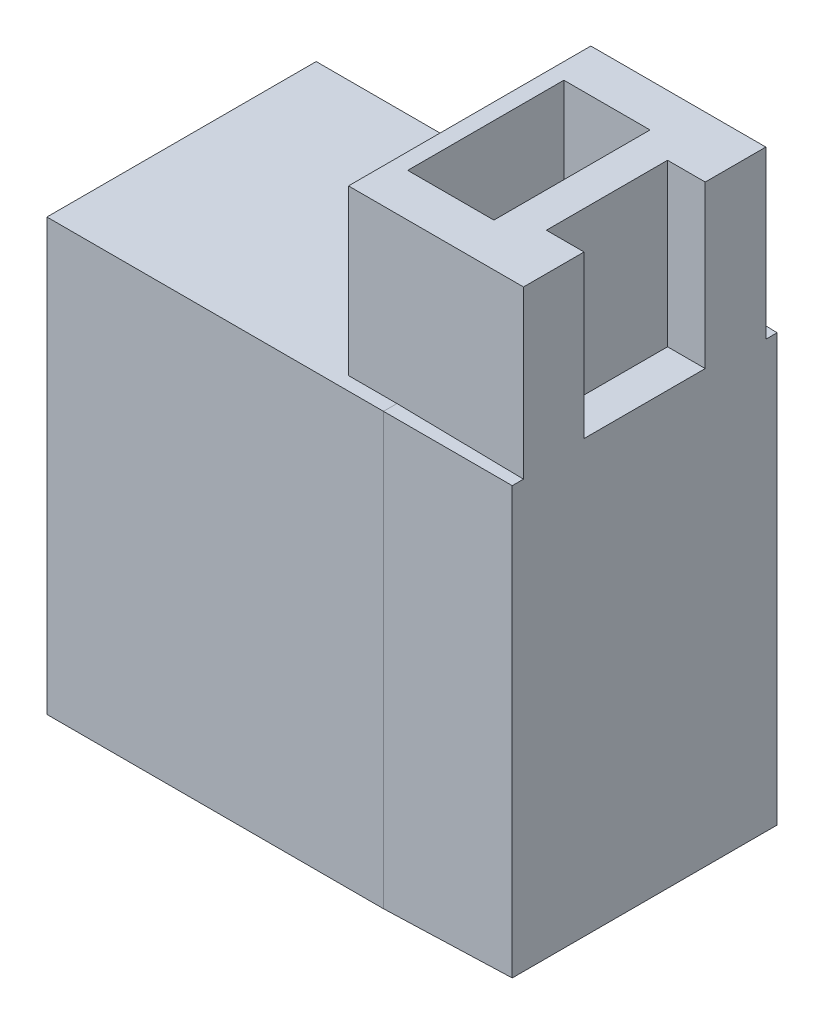
ISO-10303-21;
HEADER;
FILE_DESCRIPTION(('STEP AP214'),'2;1');
FILE_NAME('part.step','',(''),(''),'','','');
FILE_SCHEMA(('AUTOMOTIVE_DESIGN { 1 0 10303 214 1 1 1 1 }'));
ENDSEC;
DATA;
#1=APPLICATION_CONTEXT('core data for automotive mechanical design processes');
#2=APPLICATION_PROTOCOL_DEFINITION('international standard','automotive_design',2000,#1);
#3=PRODUCT_CONTEXT('',#1,'mechanical');
#4=PRODUCT('Part','Part','',(#3));
#5=PRODUCT_RELATED_PRODUCT_CATEGORY('part','',(#4));
#6=PRODUCT_DEFINITION_FORMATION('','',#4);
#7=PRODUCT_DEFINITION_CONTEXT('part definition',#1,'design');
#8=PRODUCT_DEFINITION('design','',#6,#7);
#9=PRODUCT_DEFINITION_SHAPE('','',#8);
#10=(LENGTH_UNIT() NAMED_UNIT(*) SI_UNIT(.MILLI.,.METRE.));
#11=(NAMED_UNIT(*) PLANE_ANGLE_UNIT() SI_UNIT($,.RADIAN.));
#12=(NAMED_UNIT(*) SI_UNIT($,.STERADIAN.) SOLID_ANGLE_UNIT());
#13=UNCERTAINTY_MEASURE_WITH_UNIT(LENGTH_MEASURE(1.E-05),#10,'distance_accuracy_value','');
#14=(GEOMETRIC_REPRESENTATION_CONTEXT(3) GLOBAL_UNCERTAINTY_ASSIGNED_CONTEXT((#13)) GLOBAL_UNIT_ASSIGNED_CONTEXT((#10,
#11,#12)) REPRESENTATION_CONTEXT('',''));
#15=CARTESIAN_POINT('',(0.,0.,0.));
#16=DIRECTION('',(0.,0.,1.));
#17=DIRECTION('',(1.,0.,0.));
#18=AXIS2_PLACEMENT_3D('',#15,#16,#17);
#19=CARTESIAN_POINT('',(2.,16.1,-2.9));
#20=DIRECTION('',(0.,-1.,0.));
#21=DIRECTION('',(0.,0.,-1.));
#22=AXIS2_PLACEMENT_3D('',#19,#20,#21);
#23=PLANE('',#22);
#24=DIRECTION('',(-1.,0.,0.));
#25=VECTOR('',#24,1.);
#26=CARTESIAN_POINT('',(-1.2,16.1,-2.9));
#27=LINE('',#26,#25);
#28=CARTESIAN_POINT('',(2.,16.1,-2.9));
#29=VERTEX_POINT('',#28);
#30=CARTESIAN_POINT('',(-1.2,16.1,-2.9));
#31=VERTEX_POINT('',#30);
#32=EDGE_CURVE('E149',#29,#31,#27,.T.);
#33=ORIENTED_EDGE('',*,*,#32,.T.);
#34=DIRECTION('',(0.,0.,1.));
#35=VECTOR('',#34,1.);
#36=CARTESIAN_POINT('',(-1.2,16.1,2.9));
#37=LINE('',#36,#35);
#38=CARTESIAN_POINT('',(-1.2,16.1,2.9));
#39=VERTEX_POINT('',#38);
#40=EDGE_CURVE('E20',#31,#39,#37,.T.);
#41=ORIENTED_EDGE('',*,*,#40,.T.);
#42=DIRECTION('',(1.,0.,0.));
#43=VECTOR('',#42,1.);
#44=CARTESIAN_POINT('',(-1.2,16.1,2.9));
#45=LINE('',#44,#43);
#46=CARTESIAN_POINT('',(2.,16.1,2.9));
#47=VERTEX_POINT('',#46);
#48=EDGE_CURVE('E145',#39,#47,#45,.T.);
#49=ORIENTED_EDGE('',*,*,#48,.T.);
#50=DIRECTION('',(0.,0.,-1.));
#51=VECTOR('',#50,1.);
#52=CARTESIAN_POINT('',(2.,16.1,2.9));
#53=LINE('',#52,#51);
#54=EDGE_CURVE('E167',#47,#29,#53,.T.);
#55=ORIENTED_EDGE('',*,*,#54,.T.);
#56=EDGE_LOOP('',(#33,#41,#49,#55));
#57=FACE_BOUND('',#56,.T.);
#58=ADVANCED_FACE('F17',(#57),#23,.F.);
#59=CARTESIAN_POINT('',(-1.2,16.1,2.9));
#60=DIRECTION('',(-1.,0.,0.));
#61=DIRECTION('',(0.,0.,1.));
#62=AXIS2_PLACEMENT_3D('',#59,#60,#61);
#63=PLANE('',#62);
#64=DIRECTION('',(0.,1.,0.));
#65=VECTOR('',#64,1.);
#66=CARTESIAN_POINT('',(-1.2,16.1,2.9));
#67=LINE('',#66,#65);
#68=CARTESIAN_POINT('',(-1.2,22.1,2.9));
#69=VERTEX_POINT('',#68);
#70=EDGE_CURVE('E154',#69,#39,#67,.F.);
#71=ORIENTED_EDGE('',*,*,#70,.T.);
#72=ORIENTED_EDGE('',*,*,#40,.F.);
#73=DIRECTION('',(0.,1.,0.));
#74=VECTOR('',#73,1.);
#75=CARTESIAN_POINT('',(-1.2,16.1,-2.9));
#76=LINE('',#75,#74);
#77=CARTESIAN_POINT('',(-1.2,22.1,-2.9));
#78=VERTEX_POINT('',#77);
#79=EDGE_CURVE('E173',#31,#78,#76,.T.);
#80=ORIENTED_EDGE('',*,*,#79,.T.);
#81=DIRECTION('',(0.,0.,-1.));
#82=VECTOR('',#81,1.);
#83=CARTESIAN_POINT('',(-1.2,22.1,4.5));
#84=LINE('',#83,#82);
#85=EDGE_CURVE('E164',#78,#69,#84,.F.);
#86=ORIENTED_EDGE('',*,*,#85,.T.);
#87=EDGE_LOOP('',(#71,#72,#80,#86));
#88=FACE_BOUND('',#87,.T.);
#89=ADVANCED_FACE('F163',(#88),#63,.F.);
#90=CARTESIAN_POINT('',(-1.2,16.1,2.9));
#91=DIRECTION('',(0.,0.,1.));
#92=DIRECTION('',(1.,0.,0.));
#93=AXIS2_PLACEMENT_3D('',#90,#91,#92);
#94=PLANE('',#93);
#95=DIRECTION('',(0.,1.,0.));
#96=VECTOR('',#95,1.);
#97=CARTESIAN_POINT('',(2.,16.1,2.9));
#98=LINE('',#97,#96);
#99=CARTESIAN_POINT('',(2.,22.1,2.9));
#100=VERTEX_POINT('',#99);
#101=EDGE_CURVE('E160',#100,#47,#98,.F.);
#102=ORIENTED_EDGE('',*,*,#101,.T.);
#103=ORIENTED_EDGE('',*,*,#48,.F.);
#104=ORIENTED_EDGE('',*,*,#70,.F.);
#105=DIRECTION('',(1.,0.,0.));
#106=VECTOR('',#105,1.);
#107=CARTESIAN_POINT('',(-1.8,22.1,2.9));
#108=LINE('',#107,#106);
#109=EDGE_CURVE('E183',#69,#100,#108,.T.);
#110=ORIENTED_EDGE('',*,*,#109,.T.);
#111=EDGE_LOOP('',(#102,#103,#104,#110));
#112=FACE_BOUND('',#111,.T.);
#113=ADVANCED_FACE('F157',(#112),#94,.F.);
#114=CARTESIAN_POINT('',(2.,16.1,2.9));
#115=DIRECTION('',(1.,0.,0.));
#116=DIRECTION('',(0.,0.,-1.));
#117=AXIS2_PLACEMENT_3D('',#114,#115,#116);
#118=PLANE('',#117);
#119=DIRECTION('',(0.,1.,0.));
#120=VECTOR('',#119,1.);
#121=CARTESIAN_POINT('',(2.,16.1,-2.9));
#122=LINE('',#121,#120);
#123=CARTESIAN_POINT('',(2.,22.1,-2.9));
#124=VERTEX_POINT('',#123);
#125=EDGE_CURVE('E169',#124,#29,#122,.F.);
#126=ORIENTED_EDGE('',*,*,#125,.T.);
#127=ORIENTED_EDGE('',*,*,#54,.F.);
#128=ORIENTED_EDGE('',*,*,#101,.F.);
#129=DIRECTION('',(0.,0.,-1.));
#130=VECTOR('',#129,1.);
#131=CARTESIAN_POINT('',(2.,22.1,4.5));
#132=LINE('',#131,#130);
#133=EDGE_CURVE('E185',#100,#124,#132,.T.);
#134=ORIENTED_EDGE('',*,*,#133,.T.);
#135=EDGE_LOOP('',(#126,#127,#128,#134));
#136=FACE_BOUND('',#135,.T.);
#137=ADVANCED_FACE('F378',(#136),#118,.F.);
#138=CARTESIAN_POINT('',(-1.2,16.1,-2.9));
#139=DIRECTION('',(0.,0.,-1.));
#140=DIRECTION('',(-1.,0.,0.));
#141=AXIS2_PLACEMENT_3D('',#138,#139,#140);
#142=PLANE('',#141);
#143=ORIENTED_EDGE('',*,*,#79,.F.);
#144=ORIENTED_EDGE('',*,*,#32,.F.);
#145=ORIENTED_EDGE('',*,*,#125,.F.);
#146=DIRECTION('',(1.,0.,0.));
#147=VECTOR('',#146,1.);
#148=CARTESIAN_POINT('',(-1.8,22.1,-2.9));
#149=LINE('',#148,#147);
#150=EDGE_CURVE('E188',#124,#78,#149,.F.);
#151=ORIENTED_EDGE('',*,*,#150,.T.);
#152=EDGE_LOOP('',(#143,#144,#145,#151));
#153=FACE_BOUND('',#152,.T.);
#154=ADVANCED_FACE('F370',(#153),#142,.F.);
#155=CARTESIAN_POINT('',(3.3,16.1,2.25));
#156=DIRECTION('',(-1.,0.,0.));
#157=DIRECTION('',(0.,0.,1.));
#158=AXIS2_PLACEMENT_3D('',#155,#156,#157);
#159=PLANE('',#158);
#160=DIRECTION('',(0.,1.,0.));
#161=VECTOR('',#160,1.);
#162=CARTESIAN_POINT('',(3.3,16.1,2.25));
#163=LINE('',#162,#161);
#164=CARTESIAN_POINT('',(3.3,22.1,2.25));
#165=VERTEX_POINT('',#164);
#166=CARTESIAN_POINT('',(3.3,16.1,2.25));
#167=VERTEX_POINT('',#166);
#168=EDGE_CURVE('E179',#165,#167,#163,.F.);
#169=ORIENTED_EDGE('',*,*,#168,.T.);
#170=DIRECTION('',(0.,0.,1.));
#171=VECTOR('',#170,1.);
#172=CARTESIAN_POINT('',(3.3,16.1,-2.25));
#173=LINE('',#172,#171);
#174=CARTESIAN_POINT('',(3.3,16.1,-2.25));
#175=VERTEX_POINT('',#174);
#176=EDGE_CURVE('E206',#175,#167,#173,.T.);
#177=ORIENTED_EDGE('',*,*,#176,.F.);
#178=DIRECTION('',(0.,1.,0.));
#179=VECTOR('',#178,1.);
#180=CARTESIAN_POINT('',(3.3,16.1,-2.25));
#181=LINE('',#180,#179);
#182=CARTESIAN_POINT('',(3.3,22.1,-2.25));
#183=VERTEX_POINT('',#182);
#184=EDGE_CURVE('E197',#175,#183,#181,.T.);
#185=ORIENTED_EDGE('',*,*,#184,.T.);
#186=DIRECTION('',(0.,0.,-1.));
#187=VECTOR('',#186,1.);
#188=CARTESIAN_POINT('',(3.3,22.1,4.5));
#189=LINE('',#188,#187);
#190=EDGE_CURVE('E191',#183,#165,#189,.F.);
#191=ORIENTED_EDGE('',*,*,#190,.T.);
#192=EDGE_LOOP('',(#169,#177,#185,#191));
#193=FACE_BOUND('',#192,.T.);
#194=ADVANCED_FACE('F368',(#193),#159,.F.);
#195=CARTESIAN_POINT('',(0.,16.,-5.));
#196=DIRECTION('',(0.0174524064372835,0.999847695156391,0.));
#197=DIRECTION('',(-0.999847695156391,0.0174524064372835,0.));
#198=AXIS2_PLACEMENT_3D('',#195,#196,#197);
#199=PLANE('',#198);
#200=DIRECTION('',(0.,0.,1.));
#201=VECTOR('',#200,1.);
#202=CARTESIAN_POINT('',(4.7,15.9179611948374,-5.));
#203=LINE('',#202,#201);
#204=CARTESIAN_POINT('',(4.7,15.9179611948374,-4.5));
#205=VERTEX_POINT('',#204);
#206=CARTESIAN_POINT('',(4.7,15.9179611948374,-4.91796119483738));
#207=VERTEX_POINT('',#206);
#208=EDGE_CURVE('E177',#205,#207,#203,.F.);
#209=ORIENTED_EDGE('',*,*,#208,.T.);
#210=DIRECTION('',(0.999695459881888,-0.0174497491606829,0.0174497491606827));
#211=VECTOR('',#210,1.);
#212=CARTESIAN_POINT('',(0.,16.,-5.));
#213=LINE('',#212,#211);
#214=CARTESIAN_POINT('',(0.,16.,-5.));
#215=VERTEX_POINT('',#214);
#216=EDGE_CURVE('E210',#215,#207,#213,.T.);
#217=ORIENTED_EDGE('',*,*,#216,.F.);
#218=DIRECTION('',(0.,0.,1.));
#219=VECTOR('',#218,1.);
#220=CARTESIAN_POINT('',(0.,16.,-5.));
#221=LINE('',#220,#219);
#222=CARTESIAN_POINT('',(0.,16.,-4.5));
#223=VERTEX_POINT('',#222);
#224=EDGE_CURVE('E175',#215,#223,#221,.T.);
#225=ORIENTED_EDGE('',*,*,#224,.T.);
#226=DIRECTION('',(-0.999847695156391,0.0174524064372837,0.));
#227=VECTOR('',#226,1.);
#228=CARTESIAN_POINT('',(4.7,15.9179611948374,-4.5));
#229=LINE('',#228,#227);
#230=EDGE_CURVE('E213',#205,#223,#229,.T.);
#231=ORIENTED_EDGE('',*,*,#230,.F.);
#232=EDGE_LOOP('',(#209,#217,#225,#231));
#233=FACE_BOUND('',#232,.T.);
#234=ADVANCED_FACE('F334',(#233),#199,.T.);
#235=CARTESIAN_POINT('',(4.7,16.1,2.25));
#236=DIRECTION('',(0.,0.,1.));
#237=DIRECTION('',(1.,0.,0.));
#238=AXIS2_PLACEMENT_3D('',#235,#236,#237);
#239=PLANE('',#238);
#240=DIRECTION('',(0.,1.,0.));
#241=VECTOR('',#240,1.);
#242=CARTESIAN_POINT('',(4.7,0.,2.25));
#243=LINE('',#242,#241);
#244=CARTESIAN_POINT('',(4.7,16.1,2.25));
#245=VERTEX_POINT('',#244);
#246=CARTESIAN_POINT('',(4.7,22.1,2.25));
#247=VERTEX_POINT('',#246);
#248=EDGE_CURVE('E229',#245,#247,#243,.T.);
#249=ORIENTED_EDGE('',*,*,#248,.F.);
#250=DIRECTION('',(1.,0.,0.));
#251=VECTOR('',#250,1.);
#252=CARTESIAN_POINT('',(4.7,16.1,2.25));
#253=LINE('',#252,#251);
#254=EDGE_CURVE('E208',#167,#245,#253,.T.);
#255=ORIENTED_EDGE('',*,*,#254,.F.);
#256=ORIENTED_EDGE('',*,*,#168,.F.);
#257=DIRECTION('',(1.,0.,0.));
#258=VECTOR('',#257,1.);
#259=CARTESIAN_POINT('',(-1.8,22.1,2.25));
#260=LINE('',#259,#258);
#261=EDGE_CURVE('E194',#165,#247,#260,.T.);
#262=ORIENTED_EDGE('',*,*,#261,.T.);
#263=EDGE_LOOP('',(#249,#255,#256,#262));
#264=FACE_BOUND('',#263,.T.);
#265=ADVANCED_FACE('F366',(#264),#239,.F.);
#266=CARTESIAN_POINT('',(-1.8,22.1,4.5));
#267=DIRECTION('',(0.,-1.,0.));
#268=DIRECTION('',(0.,0.,-1.));
#269=AXIS2_PLACEMENT_3D('',#266,#267,#268);
#270=PLANE('',#269);
#271=ORIENTED_EDGE('',*,*,#261,.F.);
#272=ORIENTED_EDGE('',*,*,#190,.F.);
#273=DIRECTION('',(-1.,0.,0.));
#274=VECTOR('',#273,1.);
#275=CARTESIAN_POINT('',(4.7,22.1,-2.25));
#276=LINE('',#275,#274);
#277=CARTESIAN_POINT('',(4.7,22.1,-2.25));
#278=VERTEX_POINT('',#277);
#279=EDGE_CURVE('E200',#183,#278,#276,.F.);
#280=ORIENTED_EDGE('',*,*,#279,.T.);
#281=DIRECTION('',(0.,0.,-1.));
#282=VECTOR('',#281,1.);
#283=CARTESIAN_POINT('',(4.7,22.1,-5.));
#284=LINE('',#283,#282);
#285=CARTESIAN_POINT('',(4.7,22.1,-4.5));
#286=VERTEX_POINT('',#285);
#287=EDGE_CURVE('E241',#286,#278,#284,.F.);
#288=ORIENTED_EDGE('',*,*,#287,.F.);
#289=DIRECTION('',(-1.,0.,0.));
#290=VECTOR('',#289,1.);
#291=CARTESIAN_POINT('',(4.7,22.1,-4.5));
#292=LINE('',#291,#290);
#293=CARTESIAN_POINT('',(-1.8,22.1,-4.5));
#294=VERTEX_POINT('',#293);
#295=EDGE_CURVE('E216',#294,#286,#292,.F.);
#296=ORIENTED_EDGE('',*,*,#295,.F.);
#297=DIRECTION('',(0.,0.,1.));
#298=VECTOR('',#297,1.);
#299=CARTESIAN_POINT('',(-1.8,22.1,4.5));
#300=LINE('',#299,#298);
#301=CARTESIAN_POINT('',(-1.8,22.1,4.5));
#302=VERTEX_POINT('',#301);
#303=EDGE_CURVE('E218',#294,#302,#300,.T.);
#304=ORIENTED_EDGE('',*,*,#303,.T.);
#305=DIRECTION('',(-1.,0.,0.));
#306=VECTOR('',#305,1.);
#307=CARTESIAN_POINT('',(4.7,22.1,4.5));
#308=LINE('',#307,#306);
#309=CARTESIAN_POINT('',(4.7,22.1,4.5));
#310=VERTEX_POINT('',#309);
#311=EDGE_CURVE('E226',#302,#310,#308,.F.);
#312=ORIENTED_EDGE('',*,*,#311,.T.);
#313=DIRECTION('',(0.,0.,-1.));
#314=VECTOR('',#313,1.);
#315=CARTESIAN_POINT('',(4.7,22.1,-5.));
#316=LINE('',#315,#314);
#317=EDGE_CURVE('E231',#247,#310,#316,.F.);
#318=ORIENTED_EDGE('',*,*,#317,.F.);
#319=EDGE_LOOP('',(#271,#272,#280,#288,#296,#304,#312,#318));
#320=FACE_BOUND('',#319,.T.);
#321=ORIENTED_EDGE('',*,*,#133,.F.);
#322=ORIENTED_EDGE('',*,*,#109,.F.);
#323=ORIENTED_EDGE('',*,*,#85,.F.);
#324=ORIENTED_EDGE('',*,*,#150,.F.);
#325=EDGE_LOOP('',(#321,#322,#323,#324));
#326=FACE_BOUND('',#325,.T.);
#327=ADVANCED_FACE('F352',(#320,#326),#270,.F.);
#328=CARTESIAN_POINT('',(4.7,16.1,-2.25));
#329=DIRECTION('',(0.,0.,-1.));
#330=DIRECTION('',(-1.,0.,0.));
#331=AXIS2_PLACEMENT_3D('',#328,#329,#330);
#332=PLANE('',#331);
#333=ORIENTED_EDGE('',*,*,#184,.F.);
#334=DIRECTION('',(1.,0.,0.));
#335=VECTOR('',#334,1.);
#336=CARTESIAN_POINT('',(4.7,16.1,-2.25));
#337=LINE('',#336,#335);
#338=CARTESIAN_POINT('',(4.7,16.1,-2.25));
#339=VERTEX_POINT('',#338);
#340=EDGE_CURVE('E203',#339,#175,#337,.F.);
#341=ORIENTED_EDGE('',*,*,#340,.F.);
#342=DIRECTION('',(0.,1.,0.));
#343=VECTOR('',#342,1.);
#344=CARTESIAN_POINT('',(4.7,0.,-2.25));
#345=LINE('',#344,#343);
#346=EDGE_CURVE('E243',#278,#339,#345,.F.);
#347=ORIENTED_EDGE('',*,*,#346,.F.);
#348=ORIENTED_EDGE('',*,*,#279,.F.);
#349=EDGE_LOOP('',(#333,#341,#347,#348));
#350=FACE_BOUND('',#349,.T.);
#351=ADVANCED_FACE('F359',(#350),#332,.F.);
#352=CARTESIAN_POINT('',(4.7,16.1,-2.25));
#353=DIRECTION('',(0.,1.,0.));
#354=DIRECTION('',(0.,0.,1.));
#355=AXIS2_PLACEMENT_3D('',#352,#353,#354);
#356=PLANE('',#355);
#357=ORIENTED_EDGE('',*,*,#176,.T.);
#358=ORIENTED_EDGE('',*,*,#254,.T.);
#359=DIRECTION('',(0.,0.,-1.));
#360=VECTOR('',#359,1.);
#361=CARTESIAN_POINT('',(4.7,16.1,-5.));
#362=LINE('',#361,#360);
#363=EDGE_CURVE('E245',#339,#245,#362,.F.);
#364=ORIENTED_EDGE('',*,*,#363,.F.);
#365=ORIENTED_EDGE('',*,*,#340,.T.);
#366=EDGE_LOOP('',(#357,#358,#364,#365));
#367=FACE_BOUND('',#366,.T.);
#368=ADVANCED_FACE('F363',(#367),#356,.T.);
#369=CARTESIAN_POINT('',(0.,0.,-5.));
#370=DIRECTION('',(0.0174524064372835,0.,-0.999847695156391));
#371=DIRECTION('',(-0.999847695156391,0.,-0.0174524064372835));
#372=AXIS2_PLACEMENT_3D('',#369,#370,#371);
#373=PLANE('',#372);
#374=DIRECTION('',(0.,1.,0.));
#375=VECTOR('',#374,1.);
#376=CARTESIAN_POINT('',(4.7,0.,-4.91796119483738));
#377=LINE('',#376,#375);
#378=CARTESIAN_POINT('',(4.7,0.0820388051626228,-4.91796119483738));
#379=VERTEX_POINT('',#378);
#380=EDGE_CURVE('E235',#379,#207,#377,.T.);
#381=ORIENTED_EDGE('',*,*,#380,.F.);
#382=DIRECTION('',(0.999695459881888,0.0174497491606827,0.0174497491606829));
#383=VECTOR('',#382,1.);
#384=CARTESIAN_POINT('',(0.,0.,-5.));
#385=LINE('',#384,#383);
#386=CARTESIAN_POINT('',(0.,0.,-5.));
#387=VERTEX_POINT('',#386);
#388=EDGE_CURVE('E253',#387,#379,#385,.T.);
#389=ORIENTED_EDGE('',*,*,#388,.F.);
#390=DIRECTION('',(0.,1.,0.));
#391=VECTOR('',#390,1.);
#392=CARTESIAN_POINT('',(0.,16.,-5.));
#393=LINE('',#392,#391);
#394=EDGE_CURVE('E257',#215,#387,#393,.F.);
#395=ORIENTED_EDGE('',*,*,#394,.F.);
#396=ORIENTED_EDGE('',*,*,#216,.T.);
#397=EDGE_LOOP('',(#381,#389,#395,#396));
#398=FACE_BOUND('',#397,.T.);
#399=ADVANCED_FACE('F408',(#398),#373,.T.);
#400=CARTESIAN_POINT('',(4.7,15.9179611948374,-4.5));
#401=DIRECTION('',(0.,0.,-1.));
#402=DIRECTION('',(-1.,0.,0.));
#403=AXIS2_PLACEMENT_3D('',#400,#401,#402);
#404=PLANE('',#403);
#405=ORIENTED_EDGE('',*,*,#295,.T.);
#406=DIRECTION('',(0.,1.,0.));
#407=VECTOR('',#406,1.);
#408=CARTESIAN_POINT('',(4.7,0.,-4.5));
#409=LINE('',#408,#407);
#410=EDGE_CURVE('E238',#205,#286,#409,.T.);
#411=ORIENTED_EDGE('',*,*,#410,.F.);
#412=ORIENTED_EDGE('',*,*,#230,.T.);
#413=DIRECTION('',(1.,0.,0.));
#414=VECTOR('',#413,1.);
#415=CARTESIAN_POINT('',(-12.5,16.,-4.5));
#416=LINE('',#415,#414);
#417=CARTESIAN_POINT('',(-1.8,16.,-4.5));
#418=VERTEX_POINT('',#417);
#419=EDGE_CURVE('E265',#223,#418,#416,.F.);
#420=ORIENTED_EDGE('',*,*,#419,.T.);
#421=DIRECTION('',(0.,1.,0.));
#422=VECTOR('',#421,1.);
#423=CARTESIAN_POINT('',(-1.8,22.1,-4.5));
#424=LINE('',#423,#422);
#425=EDGE_CURVE('E220',#418,#294,#424,.T.);
#426=ORIENTED_EDGE('',*,*,#425,.T.);
#427=EDGE_LOOP('',(#405,#411,#412,#420,#426));
#428=FACE_BOUND('',#427,.T.);
#429=ADVANCED_FACE('F330',(#428),#404,.T.);
#430=CARTESIAN_POINT('',(-1.8,22.1,4.5));
#431=DIRECTION('',(1.,0.,0.));
#432=DIRECTION('',(0.,1.,0.));
#433=AXIS2_PLACEMENT_3D('',#430,#431,#432);
#434=PLANE('',#433);
#435=DIRECTION('',(0.,0.,-1.));
#436=VECTOR('',#435,1.);
#437=CARTESIAN_POINT('',(-1.8,16.,5.));
#438=LINE('',#437,#436);
#439=CARTESIAN_POINT('',(-1.8,16.,4.5));
#440=VERTEX_POINT('',#439);
#441=EDGE_CURVE('E268',#418,#440,#438,.F.);
#442=ORIENTED_EDGE('',*,*,#441,.T.);
#443=DIRECTION('',(0.,1.,0.));
#444=VECTOR('',#443,1.);
#445=CARTESIAN_POINT('',(-1.8,15.9179611948374,4.5));
#446=LINE('',#445,#444);
#447=EDGE_CURVE('E223',#440,#302,#446,.T.);
#448=ORIENTED_EDGE('',*,*,#447,.T.);
#449=ORIENTED_EDGE('',*,*,#303,.F.);
#450=ORIENTED_EDGE('',*,*,#425,.F.);
#451=EDGE_LOOP('',(#442,#448,#449,#450));
#452=FACE_BOUND('',#451,.T.);
#453=ADVANCED_FACE('F326',(#452),#434,.F.);
#454=CARTESIAN_POINT('',(4.7,15.9179611948374,4.5));
#455=DIRECTION('',(0.,0.,-1.));
#456=DIRECTION('',(-1.,0.,0.));
#457=AXIS2_PLACEMENT_3D('',#454,#455,#456);
#458=PLANE('',#457);
#459=DIRECTION('',(0.,1.,0.));
#460=VECTOR('',#459,1.);
#461=CARTESIAN_POINT('',(4.7,0.,4.5));
#462=LINE('',#461,#460);
#463=CARTESIAN_POINT('',(4.7,15.9179611948374,4.5));
#464=VERTEX_POINT('',#463);
#465=EDGE_CURVE('E233',#310,#464,#462,.F.);
#466=ORIENTED_EDGE('',*,*,#465,.F.);
#467=ORIENTED_EDGE('',*,*,#311,.F.);
#468=ORIENTED_EDGE('',*,*,#447,.F.);
#469=DIRECTION('',(1.,0.,0.));
#470=VECTOR('',#469,1.);
#471=CARTESIAN_POINT('',(-12.5,16.,4.5));
#472=LINE('',#471,#470);
#473=CARTESIAN_POINT('',(0.,16.,4.5));
#474=VERTEX_POINT('',#473);
#475=EDGE_CURVE('E271',#440,#474,#472,.T.);
#476=ORIENTED_EDGE('',*,*,#475,.T.);
#477=DIRECTION('',(-0.999847695156391,0.0174524064372835,0.));
#478=VECTOR('',#477,1.);
#479=CARTESIAN_POINT('',(0.,16.,4.5));
#480=LINE('',#479,#478);
#481=EDGE_CURVE('E248',#464,#474,#480,.T.);
#482=ORIENTED_EDGE('',*,*,#481,.F.);
#483=EDGE_LOOP('',(#466,#467,#468,#476,#482));
#484=FACE_BOUND('',#483,.T.);
#485=ADVANCED_FACE('F323',(#484),#458,.F.);
#486=CARTESIAN_POINT('',(4.7,0.,-5.));
#487=DIRECTION('',(1.,0.,0.));
#488=DIRECTION('',(0.,0.,-1.));
#489=AXIS2_PLACEMENT_3D('',#486,#487,#488);
#490=PLANE('',#489);
#491=ORIENTED_EDGE('',*,*,#346,.T.);
#492=ORIENTED_EDGE('',*,*,#363,.T.);
#493=ORIENTED_EDGE('',*,*,#248,.T.);
#494=ORIENTED_EDGE('',*,*,#317,.T.);
#495=ORIENTED_EDGE('',*,*,#465,.T.);
#496=DIRECTION('',(0.,0.,1.));
#497=VECTOR('',#496,1.);
#498=CARTESIAN_POINT('',(4.7,15.9179611948374,-5.));
#499=LINE('',#498,#497);
#500=CARTESIAN_POINT('',(4.7,15.9179611948374,4.91796119483738));
#501=VERTEX_POINT('',#500);
#502=EDGE_CURVE('E250',#501,#464,#499,.F.);
#503=ORIENTED_EDGE('',*,*,#502,.F.);
#504=DIRECTION('',(0.,1.,0.));
#505=VECTOR('',#504,1.);
#506=CARTESIAN_POINT('',(4.7,16.,4.91796119483738));
#507=LINE('',#506,#505);
#508=CARTESIAN_POINT('',(4.7,0.082038805162623,4.91796119483738));
#509=VERTEX_POINT('',#508);
#510=EDGE_CURVE('E277',#509,#501,#507,.T.);
#511=ORIENTED_EDGE('',*,*,#510,.F.);
#512=DIRECTION('',(0.,0.,1.));
#513=VECTOR('',#512,1.);
#514=CARTESIAN_POINT('',(4.7,0.0820388051626228,5.));
#515=LINE('',#514,#513);
#516=EDGE_CURVE('E255',#379,#509,#515,.T.);
#517=ORIENTED_EDGE('',*,*,#516,.F.);
#518=ORIENTED_EDGE('',*,*,#380,.T.);
#519=ORIENTED_EDGE('',*,*,#208,.F.);
#520=ORIENTED_EDGE('',*,*,#410,.T.);
#521=ORIENTED_EDGE('',*,*,#287,.T.);
#522=EDGE_LOOP('',(#491,#492,#493,#494,#495,#503,#511,#517,#518,#519,#520,#521));
#523=FACE_BOUND('',#522,.T.);
#524=ADVANCED_FACE('F347',(#523),#490,.T.);
#525=CARTESIAN_POINT('',(0.,16.,-5.));
#526=DIRECTION('',(0.0174524064372835,0.999847695156391,0.));
#527=DIRECTION('',(-0.999847695156391,0.0174524064372835,0.));
#528=AXIS2_PLACEMENT_3D('',#525,#526,#527);
#529=PLANE('',#528);
#530=DIRECTION('',(-0.999695459881888,0.0174497491606829,0.0174497491606827));
#531=VECTOR('',#530,1.);
#532=CARTESIAN_POINT('',(4.7,15.9179611948374,4.91796119483738));
#533=LINE('',#532,#531);
#534=CARTESIAN_POINT('',(0.,16.,5.));
#535=VERTEX_POINT('',#534);
#536=EDGE_CURVE('E279',#501,#535,#533,.T.);
#537=ORIENTED_EDGE('',*,*,#536,.F.);
#538=ORIENTED_EDGE('',*,*,#502,.T.);
#539=ORIENTED_EDGE('',*,*,#481,.T.);
#540=DIRECTION('',(0.,0.,-1.));
#541=VECTOR('',#540,1.);
#542=CARTESIAN_POINT('',(0.,16.,5.));
#543=LINE('',#542,#541);
#544=EDGE_CURVE('E259',#474,#535,#543,.F.);
#545=ORIENTED_EDGE('',*,*,#544,.T.);
#546=EDGE_LOOP('',(#537,#538,#539,#545));
#547=FACE_BOUND('',#546,.T.);
#548=ADVANCED_FACE('F315',(#547),#529,.T.);
#549=CARTESIAN_POINT('',(0.,0.,5.));
#550=DIRECTION('',(0.0174524064372835,-0.999847695156391,0.));
#551=DIRECTION('',(0.999847695156391,0.0174524064372835,0.));
#552=AXIS2_PLACEMENT_3D('',#549,#550,#551);
#553=PLANE('',#552);
#554=ORIENTED_EDGE('',*,*,#516,.T.);
#555=DIRECTION('',(0.999695459881888,0.0174497491606829,-0.0174497491606827));
#556=VECTOR('',#555,1.);
#557=CARTESIAN_POINT('',(0.,0.,5.));
#558=LINE('',#557,#556);
#559=CARTESIAN_POINT('',(0.,0.,5.));
#560=VERTEX_POINT('',#559);
#561=EDGE_CURVE('E274',#560,#509,#558,.T.);
#562=ORIENTED_EDGE('',*,*,#561,.F.);
#563=DIRECTION('',(0.,0.,1.));
#564=VECTOR('',#563,1.);
#565=CARTESIAN_POINT('',(0.,0.,5.));
#566=LINE('',#565,#564);
#567=EDGE_CURVE('E281',#560,#387,#566,.F.);
#568=ORIENTED_EDGE('',*,*,#567,.T.);
#569=ORIENTED_EDGE('',*,*,#388,.T.);
#570=EDGE_LOOP('',(#554,#562,#568,#569));
#571=FACE_BOUND('',#570,.T.);
#572=ADVANCED_FACE('F343',(#571),#553,.T.);
#573=CARTESIAN_POINT('',(-12.5,16.,-5.));
#574=DIRECTION('',(0.,0.,-1.));
#575=DIRECTION('',(-1.,0.,0.));
#576=AXIS2_PLACEMENT_3D('',#573,#574,#575);
#577=PLANE('',#576);
#578=ORIENTED_EDGE('',*,*,#394,.T.);
#579=DIRECTION('',(1.,0.,0.));
#580=VECTOR('',#579,1.);
#581=CARTESIAN_POINT('',(-12.5,0.,-5.));
#582=LINE('',#581,#580);
#583=CARTESIAN_POINT('',(-12.5,0.,-5.));
#584=VERTEX_POINT('',#583);
#585=EDGE_CURVE('E284',#387,#584,#582,.F.);
#586=ORIENTED_EDGE('',*,*,#585,.T.);
#587=DIRECTION('',(0.,1.,0.));
#588=VECTOR('',#587,1.);
#589=CARTESIAN_POINT('',(-12.5,0.,-5.));
#590=LINE('',#589,#588);
#591=CARTESIAN_POINT('',(-12.5,16.,-5.));
#592=VERTEX_POINT('',#591);
#593=EDGE_CURVE('E290',#584,#592,#590,.T.);
#594=ORIENTED_EDGE('',*,*,#593,.T.);
#595=DIRECTION('',(1.,0.,0.));
#596=VECTOR('',#595,1.);
#597=CARTESIAN_POINT('',(-12.5,16.,-5.));
#598=LINE('',#597,#596);
#599=EDGE_CURVE('E262',#592,#215,#598,.T.);
#600=ORIENTED_EDGE('',*,*,#599,.T.);
#601=EDGE_LOOP('',(#578,#586,#594,#600));
#602=FACE_BOUND('',#601,.T.);
#603=ADVANCED_FACE('F340',(#602),#577,.T.);
#604=CARTESIAN_POINT('',(-12.5,16.,5.));
#605=DIRECTION('',(0.,-1.,0.));
#606=DIRECTION('',(0.,0.,-1.));
#607=AXIS2_PLACEMENT_3D('',#604,#605,#606);
#608=PLANE('',#607);
#609=ORIENTED_EDGE('',*,*,#441,.F.);
#610=ORIENTED_EDGE('',*,*,#419,.F.);
#611=ORIENTED_EDGE('',*,*,#224,.F.);
#612=ORIENTED_EDGE('',*,*,#599,.F.);
#613=DIRECTION('',(0.,0.,-1.));
#614=VECTOR('',#613,1.);
#615=CARTESIAN_POINT('',(-12.5,16.,5.));
#616=LINE('',#615,#614);
#617=CARTESIAN_POINT('',(-12.5,16.,5.));
#618=VERTEX_POINT('',#617);
#619=EDGE_CURVE('E286',#592,#618,#616,.F.);
#620=ORIENTED_EDGE('',*,*,#619,.T.);
#621=DIRECTION('',(-1.,0.,0.));
#622=VECTOR('',#621,1.);
#623=CARTESIAN_POINT('',(-12.5,16.,5.));
#624=LINE('',#623,#622);
#625=EDGE_CURVE('E293',#618,#535,#624,.F.);
#626=ORIENTED_EDGE('',*,*,#625,.T.);
#627=ORIENTED_EDGE('',*,*,#544,.F.);
#628=ORIENTED_EDGE('',*,*,#475,.F.);
#629=EDGE_LOOP('',(#609,#610,#611,#612,#620,#626,#627,#628));
#630=FACE_BOUND('',#629,.T.);
#631=ADVANCED_FACE('F320',(#630),#608,.F.);
#632=CARTESIAN_POINT('',(0.,16.,5.));
#633=DIRECTION('',(0.0174524064372835,0.,0.999847695156391));
#634=DIRECTION('',(0.999847695156391,0.,-0.0174524064372835));
#635=AXIS2_PLACEMENT_3D('',#632,#633,#634);
#636=PLANE('',#635);
#637=ORIENTED_EDGE('',*,*,#510,.T.);
#638=ORIENTED_EDGE('',*,*,#536,.T.);
#639=DIRECTION('',(0.,1.,0.));
#640=VECTOR('',#639,1.);
#641=CARTESIAN_POINT('',(0.,16.,5.));
#642=LINE('',#641,#640);
#643=EDGE_CURVE('E296',#535,#560,#642,.F.);
#644=ORIENTED_EDGE('',*,*,#643,.T.);
#645=ORIENTED_EDGE('',*,*,#561,.T.);
#646=EDGE_LOOP('',(#637,#638,#644,#645));
#647=FACE_BOUND('',#646,.T.);
#648=ADVANCED_FACE('F309',(#647),#636,.T.);
#649=CARTESIAN_POINT('',(-12.5,0.,5.));
#650=DIRECTION('',(0.,1.,0.));
#651=DIRECTION('',(0.,0.,1.));
#652=AXIS2_PLACEMENT_3D('',#649,#650,#651);
#653=PLANE('',#652);
#654=ORIENTED_EDGE('',*,*,#567,.F.);
#655=DIRECTION('',(-1.,0.,0.));
#656=VECTOR('',#655,1.);
#657=CARTESIAN_POINT('',(-12.5,0.,5.));
#658=LINE('',#657,#656);
#659=CARTESIAN_POINT('',(-12.5,0.,5.));
#660=VERTEX_POINT('',#659);
#661=EDGE_CURVE('E26',#560,#660,#658,.T.);
#662=ORIENTED_EDGE('',*,*,#661,.T.);
#663=DIRECTION('',(0.,0.,-1.));
#664=VECTOR('',#663,1.);
#665=CARTESIAN_POINT('',(-12.5,0.,5.));
#666=LINE('',#665,#664);
#667=EDGE_CURVE('E34',#660,#584,#666,.T.);
#668=ORIENTED_EDGE('',*,*,#667,.T.);
#669=ORIENTED_EDGE('',*,*,#585,.F.);
#670=EDGE_LOOP('',(#654,#662,#668,#669));
#671=FACE_BOUND('',#670,.T.);
#672=ADVANCED_FACE('F302',(#671),#653,.F.);
#673=CARTESIAN_POINT('',(-12.5,0.,5.));
#674=DIRECTION('',(1.,0.,0.));
#675=DIRECTION('',(0.,0.,-1.));
#676=AXIS2_PLACEMENT_3D('',#673,#674,#675);
#677=PLANE('',#676);
#678=ORIENTED_EDGE('',*,*,#667,.F.);
#679=DIRECTION('',(0.,1.,0.));
#680=VECTOR('',#679,1.);
#681=CARTESIAN_POINT('',(-12.5,16.,5.));
#682=LINE('',#681,#680);
#683=EDGE_CURVE('E11',#660,#618,#682,.T.);
#684=ORIENTED_EDGE('',*,*,#683,.T.);
#685=ORIENTED_EDGE('',*,*,#619,.F.);
#686=ORIENTED_EDGE('',*,*,#593,.F.);
#687=EDGE_LOOP('',(#678,#684,#685,#686));
#688=FACE_BOUND('',#687,.T.);
#689=ADVANCED_FACE('F339',(#688),#677,.F.);
#690=CARTESIAN_POINT('',(-12.5,16.,5.));
#691=DIRECTION('',(0.,0.,-1.));
#692=DIRECTION('',(-1.,0.,0.));
#693=AXIS2_PLACEMENT_3D('',#690,#691,#692);
#694=PLANE('',#693);
#695=ORIENTED_EDGE('',*,*,#661,.F.);
#696=ORIENTED_EDGE('',*,*,#643,.F.);
#697=ORIENTED_EDGE('',*,*,#625,.F.);
#698=ORIENTED_EDGE('',*,*,#683,.F.);
#699=EDGE_LOOP('',(#695,#696,#697,#698));
#700=FACE_BOUND('',#699,.T.);
#701=ADVANCED_FACE('F307',(#700),#694,.F.);
#702=CLOSED_SHELL('',(#58,#89,#113,#137,#154,#194,#234,#265,#327,#351,#368,#399,#429,#453,#485,
#524,#548,#572,#603,#631,#648,#672,#689,#701));
#703=MANIFOLD_SOLID_BREP('B1',#702);
#704=ADVANCED_BREP_SHAPE_REPRESENTATION('',(#18,#703),#14);
#705=SHAPE_DEFINITION_REPRESENTATION(#9,#704);
ENDSEC;
END-ISO-10303-21;
